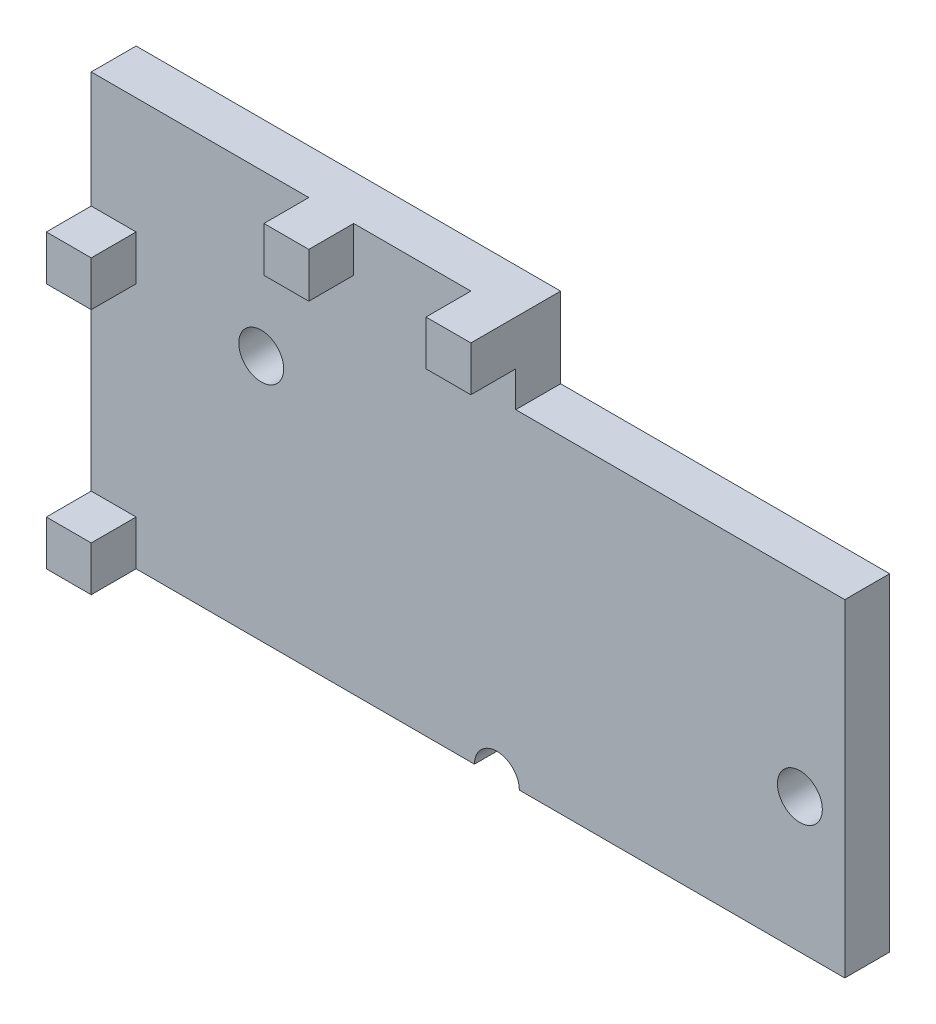
ISO-10303-21;
HEADER;
FILE_DESCRIPTION(('STEP AP214'),'2;1');
FILE_NAME('part.step','',(''),(''),'','','');
FILE_SCHEMA(('AUTOMOTIVE_DESIGN { 1 0 10303 214 1 1 1 1 }'));
ENDSEC;
DATA;
#1=APPLICATION_CONTEXT('core data for automotive mechanical design processes');
#2=APPLICATION_PROTOCOL_DEFINITION('international standard','automotive_design',2000,#1);
#3=PRODUCT_CONTEXT('',#1,'mechanical');
#4=PRODUCT('Part','Part','',(#3));
#5=PRODUCT_RELATED_PRODUCT_CATEGORY('part','',(#4));
#6=PRODUCT_DEFINITION_FORMATION('','',#4);
#7=PRODUCT_DEFINITION_CONTEXT('part definition',#1,'design');
#8=PRODUCT_DEFINITION('design','',#6,#7);
#9=PRODUCT_DEFINITION_SHAPE('','',#8);
#10=(LENGTH_UNIT() NAMED_UNIT(*) SI_UNIT(.MILLI.,.METRE.));
#11=(NAMED_UNIT(*) PLANE_ANGLE_UNIT() SI_UNIT($,.RADIAN.));
#12=(NAMED_UNIT(*) SI_UNIT($,.STERADIAN.) SOLID_ANGLE_UNIT());
#13=UNCERTAINTY_MEASURE_WITH_UNIT(LENGTH_MEASURE(1.E-05),#10,'distance_accuracy_value','');
#14=(GEOMETRIC_REPRESENTATION_CONTEXT(3) GLOBAL_UNCERTAINTY_ASSIGNED_CONTEXT((#13)) GLOBAL_UNIT_ASSIGNED_CONTEXT((#10,
#11,#12)) REPRESENTATION_CONTEXT('',''));
#15=CARTESIAN_POINT('',(0.,0.,0.));
#16=DIRECTION('',(0.,0.,1.));
#17=DIRECTION('',(1.,0.,0.));
#18=AXIS2_PLACEMENT_3D('',#15,#16,#17);
#19=CARTESIAN_POINT('',(0.169999999999999,5.8374,1.));
#20=DIRECTION('',(-1.,0.,0.));
#21=DIRECTION('',(0.,-1.,0.));
#22=AXIS2_PLACEMENT_3D('',#19,#20,#21);
#23=PLANE('',#22);
#24=DIRECTION('',(0.,0.,1.));
#25=VECTOR('',#24,1.);
#26=CARTESIAN_POINT('',(0.17,4.05,1.));
#27=LINE('',#26,#25);
#28=CARTESIAN_POINT('',(0.17,4.05,0.));
#29=VERTEX_POINT('',#28);
#30=CARTESIAN_POINT('',(0.17,4.05,1.));
#31=VERTEX_POINT('',#30);
#32=EDGE_CURVE('E51',#29,#31,#27,.T.);
#33=ORIENTED_EDGE('',*,*,#32,.F.);
#34=DIRECTION('',(0.,-1.,0.));
#35=VECTOR('',#34,1.);
#36=CARTESIAN_POINT('',(0.169999999999999,5.8374,0.));
#37=LINE('',#36,#35);
#38=CARTESIAN_POINT('',(0.169999999999999,5.8374,0.));
#39=VERTEX_POINT('',#38);
#40=EDGE_CURVE('E285',#39,#29,#37,.T.);
#41=ORIENTED_EDGE('',*,*,#40,.F.);
#42=DIRECTION('',(0.,0.,-1.));
#43=VECTOR('',#42,1.);
#44=CARTESIAN_POINT('',(0.169999999999999,5.8374,1.));
#45=LINE('',#44,#43);
#46=CARTESIAN_POINT('',(0.170000000000001,5.8374,2.));
#47=VERTEX_POINT('',#46);
#48=EDGE_CURVE('E258',#47,#39,#45,.T.);
#49=ORIENTED_EDGE('',*,*,#48,.F.);
#50=DIRECTION('',(0.,1.,0.));
#51=VECTOR('',#50,1.);
#52=CARTESIAN_POINT('',(0.170000000000001,5.8374,2.));
#53=LINE('',#52,#51);
#54=CARTESIAN_POINT('',(0.170000000000001,4.8374,2.));
#55=VERTEX_POINT('',#54);
#56=EDGE_CURVE('E238',#55,#47,#53,.T.);
#57=ORIENTED_EDGE('',*,*,#56,.F.);
#58=DIRECTION('',(0.,0.,-1.));
#59=VECTOR('',#58,1.);
#60=CARTESIAN_POINT('',(0.170000000000001,4.8374,2.));
#61=LINE('',#60,#59);
#62=CARTESIAN_POINT('',(0.170000000000001,4.8374,1.));
#63=VERTEX_POINT('',#62);
#64=EDGE_CURVE('E190',#55,#63,#61,.T.);
#65=ORIENTED_EDGE('',*,*,#64,.T.);
#66=DIRECTION('',(0.,-1.,0.));
#67=VECTOR('',#66,1.);
#68=CARTESIAN_POINT('',(0.169999999999999,5.8374,1.));
#69=LINE('',#68,#67);
#70=EDGE_CURVE('E37',#63,#31,#69,.T.);
#71=ORIENTED_EDGE('',*,*,#70,.T.);
#72=EDGE_LOOP('',(#33,#41,#49,#57,#65,#71));
#73=FACE_BOUND('',#72,.T.);
#74=ADVANCED_FACE('F33',(#73),#23,.F.);
#75=CARTESIAN_POINT('',(-0.249999999999998,-3.25,1.));
#76=DIRECTION('',(0.,0.,1.));
#77=DIRECTION('',(1.,0.,0.));
#78=AXIS2_PLACEMENT_3D('',#75,#76,#77);
#79=PLANE('',#78);
#80=CARTESIAN_POINT('',(-5.5,2.25,1.));
#81=DIRECTION('',(0.,0.,1.));
#82=DIRECTION('',(1.,0.,0.));
#83=AXIS2_PLACEMENT_3D('',#80,#81,#82);
#84=CIRCLE('',#83,0.5);
#85=CARTESIAN_POINT('',(-5.,2.25,1.));
#86=VERTEX_POINT('',#85);
#87=EDGE_CURVE('E338',#86,#86,#84,.T.);
#88=ORIENTED_EDGE('',*,*,#87,.F.);
#89=EDGE_LOOP('',(#88));
#90=FACE_BOUND('',#89,.T.);
#91=CARTESIAN_POINT('',(6.5,-0.249999999999999,1.));
#92=DIRECTION('',(0.,0.,1.));
#93=DIRECTION('',(1.,0.,0.));
#94=AXIS2_PLACEMENT_3D('',#91,#92,#93);
#95=CIRCLE('',#94,0.500000000000001);
#96=CARTESIAN_POINT('',(7.,-0.249999999999999,1.));
#97=VERTEX_POINT('',#96);
#98=EDGE_CURVE('E331',#97,#97,#95,.T.);
#99=ORIENTED_EDGE('',*,*,#98,.F.);
#100=EDGE_LOOP('',(#99));
#101=FACE_BOUND('',#100,.T.);
#102=DIRECTION('',(1.,0.,0.));
#103=VECTOR('',#102,1.);
#104=CARTESIAN_POINT('',(0.169999999999999,5.8374,1.));
#105=LINE('',#104,#103);
#106=CARTESIAN_POINT('',(-3.44,5.8374,1.));
#107=VERTEX_POINT('',#106);
#108=CARTESIAN_POINT('',(-0.829999999999999,5.8374,1.));
#109=VERTEX_POINT('',#108);
#110=EDGE_CURVE('E266',#107,#109,#105,.T.);
#111=ORIENTED_EDGE('',*,*,#110,.F.);
#112=DIRECTION('',(0.,1.,0.));
#113=VECTOR('',#112,1.);
#114=CARTESIAN_POINT('',(-3.44,5.8374,1.));
#115=LINE('',#114,#113);
#116=CARTESIAN_POINT('',(-3.44,4.8374,1.));
#117=VERTEX_POINT('',#116);
#118=EDGE_CURVE('E59',#117,#107,#115,.T.);
#119=ORIENTED_EDGE('',*,*,#118,.F.);
#120=DIRECTION('',(1.,0.,0.));
#121=VECTOR('',#120,1.);
#122=CARTESIAN_POINT('',(-3.44,4.8374,1.));
#123=LINE('',#122,#121);
#124=CARTESIAN_POINT('',(-4.44,4.8374,1.));
#125=VERTEX_POINT('',#124);
#126=EDGE_CURVE('E218',#125,#117,#123,.T.);
#127=ORIENTED_EDGE('',*,*,#126,.F.);
#128=DIRECTION('',(0.,-1.,0.));
#129=VECTOR('',#128,1.);
#130=CARTESIAN_POINT('',(-4.44,5.8374,1.));
#131=LINE('',#130,#129);
#132=CARTESIAN_POINT('',(-4.44,5.8374,1.));
#133=VERTEX_POINT('',#132);
#134=EDGE_CURVE('E226',#133,#125,#131,.T.);
#135=ORIENTED_EDGE('',*,*,#134,.F.);
#136=CARTESIAN_POINT('',(-9.2874,5.8374,1.));
#137=VERTEX_POINT('',#136);
#138=EDGE_CURVE('E194',#137,#133,#105,.T.);
#139=ORIENTED_EDGE('',*,*,#138,.F.);
#140=DIRECTION('',(0.,-1.,0.));
#141=VECTOR('',#140,1.);
#142=CARTESIAN_POINT('',(-9.2874,5.8374,1.));
#143=LINE('',#142,#141);
#144=CARTESIAN_POINT('',(-9.2874,3.25,1.));
#145=VERTEX_POINT('',#144);
#146=EDGE_CURVE('E193',#137,#145,#143,.T.);
#147=ORIENTED_EDGE('',*,*,#146,.T.);
#148=DIRECTION('',(1.,0.,0.));
#149=VECTOR('',#148,1.);
#150=CARTESIAN_POINT('',(0.17,3.25,1.));
#151=LINE('',#150,#149);
#152=CARTESIAN_POINT('',(-8.2874,3.25,1.));
#153=VERTEX_POINT('',#152);
#154=EDGE_CURVE('E257',#145,#153,#151,.T.);
#155=ORIENTED_EDGE('',*,*,#154,.T.);
#156=DIRECTION('',(0.,1.,0.));
#157=VECTOR('',#156,1.);
#158=CARTESIAN_POINT('',(-8.2874,3.25,1.));
#159=LINE('',#158,#157);
#160=CARTESIAN_POINT('',(-8.2874,2.25,1.));
#161=VERTEX_POINT('',#160);
#162=EDGE_CURVE('E299',#161,#153,#159,.T.);
#163=ORIENTED_EDGE('',*,*,#162,.F.);
#164=DIRECTION('',(1.,0.,0.));
#165=VECTOR('',#164,1.);
#166=CARTESIAN_POINT('',(-9.2874,2.25,1.));
#167=LINE('',#166,#165);
#168=CARTESIAN_POINT('',(-9.2874,2.25,1.));
#169=VERTEX_POINT('',#168);
#170=EDGE_CURVE('E294',#169,#161,#167,.T.);
#171=ORIENTED_EDGE('',*,*,#170,.F.);
#172=DIRECTION('',(0.,1.,0.));
#173=VECTOR('',#172,1.);
#174=CARTESIAN_POINT('',(-9.2874,3.25,1.));
#175=LINE('',#174,#173);
#176=CARTESIAN_POINT('',(-9.2874,-2.25,1.));
#177=VERTEX_POINT('',#176);
#178=EDGE_CURVE('E321',#177,#169,#175,.T.);
#179=ORIENTED_EDGE('',*,*,#178,.F.);
#180=DIRECTION('',(-1.,0.,0.));
#181=VECTOR('',#180,1.);
#182=CARTESIAN_POINT('',(-9.2874,-2.25,1.));
#183=LINE('',#182,#181);
#184=CARTESIAN_POINT('',(-8.28739999999999,-2.25,1.));
#185=VERTEX_POINT('',#184);
#186=EDGE_CURVE('E276',#185,#177,#183,.T.);
#187=ORIENTED_EDGE('',*,*,#186,.F.);
#188=DIRECTION('',(0.,1.,0.));
#189=VECTOR('',#188,1.);
#190=CARTESIAN_POINT('',(-8.28739999999999,-3.25,1.));
#191=LINE('',#190,#189);
#192=CARTESIAN_POINT('',(-8.28739999999999,-3.25,1.));
#193=VERTEX_POINT('',#192);
#194=EDGE_CURVE('E283',#193,#185,#191,.T.);
#195=ORIENTED_EDGE('',*,*,#194,.F.);
#196=DIRECTION('',(1.,0.,0.));
#197=VECTOR('',#196,1.);
#198=CARTESIAN_POINT('',(-0.749999999999998,-3.25,1.));
#199=LINE('',#198,#197);
#200=CARTESIAN_POINT('',(-0.749999999999998,-3.25,1.));
#201=VERTEX_POINT('',#200);
#202=EDGE_CURVE('E344',#193,#201,#199,.T.);
#203=ORIENTED_EDGE('',*,*,#202,.T.);
#204=CARTESIAN_POINT('',(-0.249999999999998,-3.25,1.));
#205=DIRECTION('',(0.,0.,-1.));
#206=DIRECTION('',(1.,0.,0.));
#207=AXIS2_PLACEMENT_3D('',#204,#205,#206);
#208=CIRCLE('',#207,0.5);
#209=CARTESIAN_POINT('',(0.250000000000002,-3.25,1.));
#210=VERTEX_POINT('',#209);
#211=EDGE_CURVE('E346',#201,#210,#208,.T.);
#212=ORIENTED_EDGE('',*,*,#211,.T.);
#213=DIRECTION('',(1.,0.,0.));
#214=VECTOR('',#213,1.);
#215=CARTESIAN_POINT('',(7.5,-3.25,1.));
#216=LINE('',#215,#214);
#217=CARTESIAN_POINT('',(7.5,-3.25,1.));
#218=VERTEX_POINT('',#217);
#219=EDGE_CURVE('E349',#210,#218,#216,.T.);
#220=ORIENTED_EDGE('',*,*,#219,.T.);
#221=DIRECTION('',(0.,1.,0.));
#222=VECTOR('',#221,1.);
#223=CARTESIAN_POINT('',(7.5,3.25,1.));
#224=LINE('',#223,#222);
#225=CARTESIAN_POINT('',(7.5,4.05,1.));
#226=VERTEX_POINT('',#225);
#227=EDGE_CURVE('E200',#218,#226,#224,.T.);
#228=ORIENTED_EDGE('',*,*,#227,.T.);
#229=DIRECTION('',(1.,0.,0.));
#230=VECTOR('',#229,1.);
#231=CARTESIAN_POINT('',(0.17,4.05,1.));
#232=LINE('',#231,#230);
#233=EDGE_CURVE('E196',#31,#226,#232,.T.);
#234=ORIENTED_EDGE('',*,*,#233,.F.);
#235=ORIENTED_EDGE('',*,*,#70,.F.);
#236=DIRECTION('',(1.,0.,0.));
#237=VECTOR('',#236,1.);
#238=CARTESIAN_POINT('',(0.170000000000001,4.8374,1.));
#239=LINE('',#238,#237);
#240=CARTESIAN_POINT('',(-0.829999999999999,4.8374,1.));
#241=VERTEX_POINT('',#240);
#242=EDGE_CURVE('E242',#241,#63,#239,.T.);
#243=ORIENTED_EDGE('',*,*,#242,.F.);
#244=DIRECTION('',(0.,-1.,0.));
#245=VECTOR('',#244,1.);
#246=CARTESIAN_POINT('',(-0.829999999999999,5.8374,1.));
#247=LINE('',#246,#245);
#248=EDGE_CURVE('E237',#109,#241,#247,.T.);
#249=ORIENTED_EDGE('',*,*,#248,.F.);
#250=EDGE_LOOP('',(#111,#119,#127,#135,#139,#147,#155,#163,#171,#179,#187,#195,#203,#212,#220,
#228,#234,#235,#243,#249));
#251=FACE_BOUND('',#250,.T.);
#252=ADVANCED_FACE('F198',(#90,#101,#251),#79,.T.);
#253=CARTESIAN_POINT('',(7.5,3.25,1.));
#254=DIRECTION('',(0.,-1.,0.));
#255=DIRECTION('',(1.,0.,0.));
#256=AXIS2_PLACEMENT_3D('',#253,#254,#255);
#257=PLANE('',#256);
#258=ORIENTED_EDGE('',*,*,#154,.F.);
#259=DIRECTION('',(0.,0.,-1.));
#260=VECTOR('',#259,1.);
#261=CARTESIAN_POINT('',(-9.2874,3.25,0.));
#262=LINE('',#261,#260);
#263=CARTESIAN_POINT('',(-9.2874,3.25,2.));
#264=VERTEX_POINT('',#263);
#265=EDGE_CURVE('E324',#264,#145,#262,.T.);
#266=ORIENTED_EDGE('',*,*,#265,.F.);
#267=DIRECTION('',(-1.,0.,0.));
#268=VECTOR('',#267,1.);
#269=CARTESIAN_POINT('',(-9.2874,3.25,2.));
#270=LINE('',#269,#268);
#271=CARTESIAN_POINT('',(-8.2874,3.25,2.));
#272=VERTEX_POINT('',#271);
#273=EDGE_CURVE('E303',#272,#264,#270,.T.);
#274=ORIENTED_EDGE('',*,*,#273,.F.);
#275=DIRECTION('',(0.,0.,-1.));
#276=VECTOR('',#275,1.);
#277=CARTESIAN_POINT('',(-8.2874,3.25,2.));
#278=LINE('',#277,#276);
#279=EDGE_CURVE('E306',#272,#153,#278,.T.);
#280=ORIENTED_EDGE('',*,*,#279,.T.);
#281=EDGE_LOOP('',(#258,#266,#274,#280));
#282=FACE_BOUND('',#281,.T.);
#283=ADVANCED_FACE('F387',(#282),#257,.F.);
#284=CARTESIAN_POINT('',(-0.249999999999998,-3.25,0.));
#285=DIRECTION('',(0.,0.,1.));
#286=DIRECTION('',(1.,0.,0.));
#287=AXIS2_PLACEMENT_3D('',#284,#285,#286);
#288=PLANE('',#287);
#289=DIRECTION('',(1.,0.,0.));
#290=VECTOR('',#289,1.);
#291=CARTESIAN_POINT('',(-0.749999999999998,-3.25,0.));
#292=LINE('',#291,#290);
#293=CARTESIAN_POINT('',(-9.2874,-3.25,0.));
#294=VERTEX_POINT('',#293);
#295=CARTESIAN_POINT('',(-0.749999999999998,-3.25,0.));
#296=VERTEX_POINT('',#295);
#297=EDGE_CURVE('E341',#294,#296,#292,.T.);
#298=ORIENTED_EDGE('',*,*,#297,.F.);
#299=DIRECTION('',(0.,-1.,0.));
#300=VECTOR('',#299,1.);
#301=CARTESIAN_POINT('',(-9.2874,3.25,0.));
#302=LINE('',#301,#300);
#303=CARTESIAN_POINT('',(-9.2874,5.8374,0.));
#304=VERTEX_POINT('',#303);
#305=EDGE_CURVE('E368',#304,#294,#302,.T.);
#306=ORIENTED_EDGE('',*,*,#305,.F.);
#307=DIRECTION('',(-1.,0.,0.));
#308=VECTOR('',#307,1.);
#309=CARTESIAN_POINT('',(0.169999999999999,5.8374,0.));
#310=LINE('',#309,#308);
#311=EDGE_CURVE('E261',#39,#304,#310,.T.);
#312=ORIENTED_EDGE('',*,*,#311,.F.);
#313=ORIENTED_EDGE('',*,*,#40,.T.);
#314=DIRECTION('',(-1.,0.,0.));
#315=VECTOR('',#314,1.);
#316=CARTESIAN_POINT('',(0.17,4.05,0.));
#317=LINE('',#316,#315);
#318=CARTESIAN_POINT('',(7.5,4.05,0.));
#319=VERTEX_POINT('',#318);
#320=EDGE_CURVE('E209',#319,#29,#317,.T.);
#321=ORIENTED_EDGE('',*,*,#320,.F.);
#322=DIRECTION('',(0.,1.,0.));
#323=VECTOR('',#322,1.);
#324=CARTESIAN_POINT('',(7.5,3.25,0.));
#325=LINE('',#324,#323);
#326=CARTESIAN_POINT('',(7.5,-3.25,0.));
#327=VERTEX_POINT('',#326);
#328=EDGE_CURVE('E347',#327,#319,#325,.T.);
#329=ORIENTED_EDGE('',*,*,#328,.F.);
#330=DIRECTION('',(1.,0.,0.));
#331=VECTOR('',#330,1.);
#332=CARTESIAN_POINT('',(7.5,-3.25,0.));
#333=LINE('',#332,#331);
#334=CARTESIAN_POINT('',(0.250000000000002,-3.25,0.));
#335=VERTEX_POINT('',#334);
#336=EDGE_CURVE('E356',#335,#327,#333,.T.);
#337=ORIENTED_EDGE('',*,*,#336,.F.);
#338=CARTESIAN_POINT('',(-0.249999999999998,-3.25,0.));
#339=DIRECTION('',(0.,0.,-1.));
#340=DIRECTION('',(1.,0.,0.));
#341=AXIS2_PLACEMENT_3D('',#338,#339,#340);
#342=CIRCLE('',#341,0.5);
#343=EDGE_CURVE('E354',#296,#335,#342,.T.);
#344=ORIENTED_EDGE('',*,*,#343,.F.);
#345=EDGE_LOOP('',(#298,#306,#312,#313,#321,#329,#337,#344));
#346=FACE_BOUND('',#345,.T.);
#347=CARTESIAN_POINT('',(-5.5,2.25,0.));
#348=DIRECTION('',(0.,0.,1.));
#349=DIRECTION('',(1.,0.,0.));
#350=AXIS2_PLACEMENT_3D('',#347,#348,#349);
#351=CIRCLE('',#350,0.5);
#352=CARTESIAN_POINT('',(-5.,2.25,0.));
#353=VERTEX_POINT('',#352);
#354=EDGE_CURVE('E334',#353,#353,#351,.T.);
#355=ORIENTED_EDGE('',*,*,#354,.T.);
#356=EDGE_LOOP('',(#355));
#357=FACE_BOUND('',#356,.T.);
#358=CARTESIAN_POINT('',(6.5,-0.249999999999999,0.));
#359=DIRECTION('',(0.,0.,1.));
#360=DIRECTION('',(1.,0.,0.));
#361=AXIS2_PLACEMENT_3D('',#358,#359,#360);
#362=CIRCLE('',#361,0.500000000000001);
#363=CARTESIAN_POINT('',(7.,-0.249999999999999,0.));
#364=VERTEX_POINT('',#363);
#365=EDGE_CURVE('E335',#364,#364,#362,.T.);
#366=ORIENTED_EDGE('',*,*,#365,.T.);
#367=EDGE_LOOP('',(#366));
#368=FACE_BOUND('',#367,.T.);
#369=ADVANCED_FACE('F453',(#346,#357,#368),#288,.F.);
#370=CARTESIAN_POINT('',(-0.749999999999998,-3.25,1.));
#371=DIRECTION('',(0.,1.,0.));
#372=DIRECTION('',(-1.,0.,0.));
#373=AXIS2_PLACEMENT_3D('',#370,#371,#372);
#374=PLANE('',#373);
#375=ORIENTED_EDGE('',*,*,#297,.T.);
#376=DIRECTION('',(0.,0.,-1.));
#377=VECTOR('',#376,1.);
#378=CARTESIAN_POINT('',(-0.749999999999998,-3.25,1.));
#379=LINE('',#378,#377);
#380=EDGE_CURVE('E11',#201,#296,#379,.T.);
#381=ORIENTED_EDGE('',*,*,#380,.F.);
#382=ORIENTED_EDGE('',*,*,#202,.F.);
#383=DIRECTION('',(0.,0.,-1.));
#384=VECTOR('',#383,1.);
#385=CARTESIAN_POINT('',(-8.28739999999999,-3.25,2.));
#386=LINE('',#385,#384);
#387=CARTESIAN_POINT('',(-8.28739999999999,-3.25,2.));
#388=VERTEX_POINT('',#387);
#389=EDGE_CURVE('E292',#388,#193,#386,.T.);
#390=ORIENTED_EDGE('',*,*,#389,.F.);
#391=DIRECTION('',(1.,0.,0.));
#392=VECTOR('',#391,1.);
#393=CARTESIAN_POINT('',(-9.2874,-3.25,2.));
#394=LINE('',#393,#392);
#395=CARTESIAN_POINT('',(-9.2874,-3.25,2.));
#396=VERTEX_POINT('',#395);
#397=EDGE_CURVE('E275',#396,#388,#394,.T.);
#398=ORIENTED_EDGE('',*,*,#397,.F.);
#399=DIRECTION('',(0.,0.,1.));
#400=VECTOR('',#399,1.);
#401=CARTESIAN_POINT('',(-9.2874,-3.25,0.));
#402=LINE('',#401,#400);
#403=EDGE_CURVE('E325',#294,#396,#402,.T.);
#404=ORIENTED_EDGE('',*,*,#403,.F.);
#405=EDGE_LOOP('',(#375,#381,#382,#390,#398,#404));
#406=FACE_BOUND('',#405,.T.);
#407=ADVANCED_FACE('F35',(#406),#374,.F.);
#408=CARTESIAN_POINT('',(-0.249999999999998,-3.25,1.));
#409=DIRECTION('',(0.,0.,-1.));
#410=DIRECTION('',(-1.,0.,0.));
#411=AXIS2_PLACEMENT_3D('',#408,#409,#410);
#412=CYLINDRICAL_SURFACE('',#411,0.5);
#413=ORIENTED_EDGE('',*,*,#343,.T.);
#414=DIRECTION('',(0.,0.,-1.));
#415=VECTOR('',#414,1.);
#416=CARTESIAN_POINT('',(0.250000000000002,-3.25,1.));
#417=LINE('',#416,#415);
#418=EDGE_CURVE('E43',#210,#335,#417,.T.);
#419=ORIENTED_EDGE('',*,*,#418,.F.);
#420=ORIENTED_EDGE('',*,*,#211,.F.);
#421=ORIENTED_EDGE('',*,*,#380,.T.);
#422=EDGE_LOOP('',(#413,#419,#420,#421));
#423=FACE_BOUND('',#422,.T.);
#424=ADVANCED_FACE('F443',(#423),#412,.F.);
#425=CARTESIAN_POINT('',(7.5,-3.25,1.));
#426=DIRECTION('',(0.,1.,0.));
#427=DIRECTION('',(-1.,0.,0.));
#428=AXIS2_PLACEMENT_3D('',#425,#426,#427);
#429=PLANE('',#428);
#430=ORIENTED_EDGE('',*,*,#336,.T.);
#431=DIRECTION('',(0.,0.,-1.));
#432=VECTOR('',#431,1.);
#433=CARTESIAN_POINT('',(7.5,-3.25,1.));
#434=LINE('',#433,#432);
#435=EDGE_CURVE('E352',#218,#327,#434,.T.);
#436=ORIENTED_EDGE('',*,*,#435,.F.);
#437=ORIENTED_EDGE('',*,*,#219,.F.);
#438=ORIENTED_EDGE('',*,*,#418,.T.);
#439=EDGE_LOOP('',(#430,#436,#437,#438));
#440=FACE_BOUND('',#439,.T.);
#441=ADVANCED_FACE('F447',(#440),#429,.F.);
#442=CARTESIAN_POINT('',(7.5,3.25,1.));
#443=DIRECTION('',(-1.,0.,0.));
#444=DIRECTION('',(0.,-1.,0.));
#445=AXIS2_PLACEMENT_3D('',#442,#443,#444);
#446=PLANE('',#445);
#447=ORIENTED_EDGE('',*,*,#328,.T.);
#448=DIRECTION('',(0.,0.,-1.));
#449=VECTOR('',#448,1.);
#450=CARTESIAN_POINT('',(7.5,4.05,1.));
#451=LINE('',#450,#449);
#452=EDGE_CURVE('E204',#226,#319,#451,.T.);
#453=ORIENTED_EDGE('',*,*,#452,.F.);
#454=ORIENTED_EDGE('',*,*,#227,.F.);
#455=ORIENTED_EDGE('',*,*,#435,.T.);
#456=EDGE_LOOP('',(#447,#453,#454,#455));
#457=FACE_BOUND('',#456,.T.);
#458=ADVANCED_FACE('F451',(#457),#446,.F.);
#459=CARTESIAN_POINT('',(-5.5,2.25,1.));
#460=DIRECTION('',(0.,0.,-1.));
#461=DIRECTION('',(-1.,0.,0.));
#462=AXIS2_PLACEMENT_3D('',#459,#460,#461);
#463=CYLINDRICAL_SURFACE('',#462,0.5);
#464=ORIENTED_EDGE('',*,*,#87,.T.);
#465=EDGE_LOOP('',(#464));
#466=FACE_BOUND('',#465,.T.);
#467=ORIENTED_EDGE('',*,*,#354,.F.);
#468=EDGE_LOOP('',(#467));
#469=FACE_BOUND('',#468,.T.);
#470=ADVANCED_FACE('F507',(#466,#469),#463,.F.);
#471=CARTESIAN_POINT('',(6.5,-0.249999999999999,1.));
#472=DIRECTION('',(0.,0.,-1.));
#473=DIRECTION('',(-1.,0.,0.));
#474=AXIS2_PLACEMENT_3D('',#471,#472,#473);
#475=CYLINDRICAL_SURFACE('',#474,0.500000000000001);
#476=ORIENTED_EDGE('',*,*,#98,.T.);
#477=EDGE_LOOP('',(#476));
#478=FACE_BOUND('',#477,.T.);
#479=ORIENTED_EDGE('',*,*,#365,.F.);
#480=EDGE_LOOP('',(#479));
#481=FACE_BOUND('',#480,.T.);
#482=ADVANCED_FACE('F574',(#478,#481),#475,.F.);
#483=CARTESIAN_POINT('',(-9.2874,0.,0.));
#484=DIRECTION('',(-1.,0.,0.));
#485=DIRECTION('',(0.,0.,1.));
#486=AXIS2_PLACEMENT_3D('',#483,#484,#485);
#487=PLANE('',#486);
#488=ORIENTED_EDGE('',*,*,#305,.T.);
#489=ORIENTED_EDGE('',*,*,#403,.T.);
#490=DIRECTION('',(0.,-1.,0.));
#491=VECTOR('',#490,1.);
#492=CARTESIAN_POINT('',(-9.2874,-3.25,2.));
#493=LINE('',#492,#491);
#494=CARTESIAN_POINT('',(-9.2874,-2.25,2.));
#495=VERTEX_POINT('',#494);
#496=EDGE_CURVE('E272',#495,#396,#493,.T.);
#497=ORIENTED_EDGE('',*,*,#496,.F.);
#498=DIRECTION('',(0.,0.,-1.));
#499=VECTOR('',#498,1.);
#500=CARTESIAN_POINT('',(-9.2874,-2.25,2.));
#501=LINE('',#500,#499);
#502=EDGE_CURVE('E282',#495,#177,#501,.T.);
#503=ORIENTED_EDGE('',*,*,#502,.T.);
#504=ORIENTED_EDGE('',*,*,#178,.T.);
#505=DIRECTION('',(0.,0.,-1.));
#506=VECTOR('',#505,1.);
#507=CARTESIAN_POINT('',(-9.2874,2.25,2.));
#508=LINE('',#507,#506);
#509=CARTESIAN_POINT('',(-9.2874,2.25,2.));
#510=VERTEX_POINT('',#509);
#511=EDGE_CURVE('E366',#510,#169,#508,.T.);
#512=ORIENTED_EDGE('',*,*,#511,.F.);
#513=DIRECTION('',(0.,-1.,0.));
#514=VECTOR('',#513,1.);
#515=CARTESIAN_POINT('',(-9.2874,3.25,2.));
#516=LINE('',#515,#514);
#517=EDGE_CURVE('E295',#264,#510,#516,.T.);
#518=ORIENTED_EDGE('',*,*,#517,.F.);
#519=ORIENTED_EDGE('',*,*,#265,.T.);
#520=ORIENTED_EDGE('',*,*,#146,.F.);
#521=DIRECTION('',(0.,0.,1.));
#522=VECTOR('',#521,1.);
#523=CARTESIAN_POINT('',(-9.2874,5.8374,1.));
#524=LINE('',#523,#522);
#525=EDGE_CURVE('E264',#304,#137,#524,.T.);
#526=ORIENTED_EDGE('',*,*,#525,.F.);
#527=EDGE_LOOP('',(#488,#489,#497,#503,#504,#512,#518,#519,#520,#526));
#528=FACE_BOUND('',#527,.T.);
#529=ADVANCED_FACE('F391',(#528),#487,.T.);
#530=CARTESIAN_POINT('',(-9.2874,2.25,2.));
#531=DIRECTION('',(0.,1.,0.));
#532=DIRECTION('',(0.,0.,1.));
#533=AXIS2_PLACEMENT_3D('',#530,#531,#532);
#534=PLANE('',#533);
#535=ORIENTED_EDGE('',*,*,#170,.T.);
#536=DIRECTION('',(0.,0.,-1.));
#537=VECTOR('',#536,1.);
#538=CARTESIAN_POINT('',(-8.2874,2.25,2.));
#539=LINE('',#538,#537);
#540=CARTESIAN_POINT('',(-8.2874,2.25,2.));
#541=VERTEX_POINT('',#540);
#542=EDGE_CURVE('E309',#541,#161,#539,.T.);
#543=ORIENTED_EDGE('',*,*,#542,.F.);
#544=DIRECTION('',(1.,0.,0.));
#545=VECTOR('',#544,1.);
#546=CARTESIAN_POINT('',(-9.2874,2.25,2.));
#547=LINE('',#546,#545);
#548=EDGE_CURVE('E298',#510,#541,#547,.T.);
#549=ORIENTED_EDGE('',*,*,#548,.F.);
#550=ORIENTED_EDGE('',*,*,#511,.T.);
#551=EDGE_LOOP('',(#535,#543,#549,#550));
#552=FACE_BOUND('',#551,.T.);
#553=ADVANCED_FACE('F378',(#552),#534,.F.);
#554=CARTESIAN_POINT('',(-8.2874,3.25,2.));
#555=DIRECTION('',(-1.,0.,0.));
#556=DIRECTION('',(0.,0.,1.));
#557=AXIS2_PLACEMENT_3D('',#554,#555,#556);
#558=PLANE('',#557);
#559=ORIENTED_EDGE('',*,*,#162,.T.);
#560=ORIENTED_EDGE('',*,*,#279,.F.);
#561=DIRECTION('',(0.,1.,0.));
#562=VECTOR('',#561,1.);
#563=CARTESIAN_POINT('',(-8.2874,3.25,2.));
#564=LINE('',#563,#562);
#565=EDGE_CURVE('E301',#541,#272,#564,.T.);
#566=ORIENTED_EDGE('',*,*,#565,.F.);
#567=ORIENTED_EDGE('',*,*,#542,.T.);
#568=EDGE_LOOP('',(#559,#560,#566,#567));
#569=FACE_BOUND('',#568,.T.);
#570=ADVANCED_FACE('F376',(#569),#558,.F.);
#571=CARTESIAN_POINT('',(0.,0.,2.));
#572=DIRECTION('',(0.,0.,1.));
#573=DIRECTION('',(1.,0.,0.));
#574=AXIS2_PLACEMENT_3D('',#571,#572,#573);
#575=PLANE('',#574);
#576=ORIENTED_EDGE('',*,*,#517,.T.);
#577=ORIENTED_EDGE('',*,*,#548,.T.);
#578=ORIENTED_EDGE('',*,*,#565,.T.);
#579=ORIENTED_EDGE('',*,*,#273,.T.);
#580=EDGE_LOOP('',(#576,#577,#578,#579));
#581=FACE_BOUND('',#580,.T.);
#582=ADVANCED_FACE('F394',(#581),#575,.T.);
#583=CARTESIAN_POINT('',(-8.28739999999999,-3.25,2.));
#584=DIRECTION('',(-1.,0.,0.));
#585=DIRECTION('',(0.,-1.,0.));
#586=AXIS2_PLACEMENT_3D('',#583,#584,#585);
#587=PLANE('',#586);
#588=ORIENTED_EDGE('',*,*,#194,.T.);
#589=DIRECTION('',(0.,0.,-1.));
#590=VECTOR('',#589,1.);
#591=CARTESIAN_POINT('',(-8.28739999999999,-2.25,2.));
#592=LINE('',#591,#590);
#593=CARTESIAN_POINT('',(-8.28739999999999,-2.25,2.));
#594=VERTEX_POINT('',#593);
#595=EDGE_CURVE('E289',#594,#185,#592,.T.);
#596=ORIENTED_EDGE('',*,*,#595,.F.);
#597=DIRECTION('',(0.,1.,0.));
#598=VECTOR('',#597,1.);
#599=CARTESIAN_POINT('',(-8.28739999999999,-3.25,2.));
#600=LINE('',#599,#598);
#601=EDGE_CURVE('E278',#388,#594,#600,.T.);
#602=ORIENTED_EDGE('',*,*,#601,.F.);
#603=ORIENTED_EDGE('',*,*,#389,.T.);
#604=EDGE_LOOP('',(#588,#596,#602,#603));
#605=FACE_BOUND('',#604,.T.);
#606=ADVANCED_FACE('F396',(#605),#587,.F.);
#607=CARTESIAN_POINT('',(-9.2874,-2.25,2.));
#608=DIRECTION('',(0.,-1.,0.));
#609=DIRECTION('',(0.,0.,-1.));
#610=AXIS2_PLACEMENT_3D('',#607,#608,#609);
#611=PLANE('',#610);
#612=ORIENTED_EDGE('',*,*,#186,.T.);
#613=ORIENTED_EDGE('',*,*,#502,.F.);
#614=DIRECTION('',(-1.,0.,0.));
#615=VECTOR('',#614,1.);
#616=CARTESIAN_POINT('',(-9.2874,-2.25,2.));
#617=LINE('',#616,#615);
#618=EDGE_CURVE('E280',#594,#495,#617,.T.);
#619=ORIENTED_EDGE('',*,*,#618,.F.);
#620=ORIENTED_EDGE('',*,*,#595,.T.);
#621=EDGE_LOOP('',(#612,#613,#619,#620));
#622=FACE_BOUND('',#621,.T.);
#623=ADVANCED_FACE('F402',(#622),#611,.F.);
#624=CARTESIAN_POINT('',(0.,0.,2.));
#625=DIRECTION('',(0.,0.,-1.));
#626=DIRECTION('',(-1.,0.,0.));
#627=AXIS2_PLACEMENT_3D('',#624,#625,#626);
#628=PLANE('',#627);
#629=ORIENTED_EDGE('',*,*,#496,.T.);
#630=ORIENTED_EDGE('',*,*,#397,.T.);
#631=ORIENTED_EDGE('',*,*,#601,.T.);
#632=ORIENTED_EDGE('',*,*,#618,.T.);
#633=EDGE_LOOP('',(#629,#630,#631,#632));
#634=FACE_BOUND('',#633,.T.);
#635=ADVANCED_FACE('F419',(#634),#628,.F.);
#636=CARTESIAN_POINT('',(0.,5.8374,0.));
#637=DIRECTION('',(0.,1.,0.));
#638=DIRECTION('',(-1.,0.,0.));
#639=AXIS2_PLACEMENT_3D('',#636,#637,#638);
#640=PLANE('',#639);
#641=ORIENTED_EDGE('',*,*,#48,.T.);
#642=ORIENTED_EDGE('',*,*,#311,.T.);
#643=ORIENTED_EDGE('',*,*,#525,.T.);
#644=ORIENTED_EDGE('',*,*,#138,.T.);
#645=DIRECTION('',(0.,0.,-1.));
#646=VECTOR('',#645,1.);
#647=CARTESIAN_POINT('',(-4.44,5.8374,2.));
#648=LINE('',#647,#646);
#649=CARTESIAN_POINT('',(-4.44,5.8374,2.));
#650=VERTEX_POINT('',#649);
#651=EDGE_CURVE('E233',#650,#133,#648,.T.);
#652=ORIENTED_EDGE('',*,*,#651,.F.);
#653=DIRECTION('',(-1.,0.,0.));
#654=VECTOR('',#653,1.);
#655=CARTESIAN_POINT('',(-3.44,5.8374,2.));
#656=LINE('',#655,#654);
#657=CARTESIAN_POINT('',(-3.44,5.8374,2.));
#658=VERTEX_POINT('',#657);
#659=EDGE_CURVE('E217',#658,#650,#656,.T.);
#660=ORIENTED_EDGE('',*,*,#659,.F.);
#661=DIRECTION('',(0.,0.,-1.));
#662=VECTOR('',#661,1.);
#663=CARTESIAN_POINT('',(-3.44,5.8374,2.));
#664=LINE('',#663,#662);
#665=EDGE_CURVE('E235',#658,#107,#664,.T.);
#666=ORIENTED_EDGE('',*,*,#665,.T.);
#667=ORIENTED_EDGE('',*,*,#110,.T.);
#668=DIRECTION('',(0.,0.,-1.));
#669=VECTOR('',#668,1.);
#670=CARTESIAN_POINT('',(-0.829999999999999,5.8374,2.));
#671=LINE('',#670,#669);
#672=CARTESIAN_POINT('',(-0.829999999999999,5.8374,2.));
#673=VERTEX_POINT('',#672);
#674=EDGE_CURVE('E254',#673,#109,#671,.T.);
#675=ORIENTED_EDGE('',*,*,#674,.F.);
#676=DIRECTION('',(-1.,0.,0.));
#677=VECTOR('',#676,1.);
#678=CARTESIAN_POINT('',(0.170000000000001,5.8374,2.));
#679=LINE('',#678,#677);
#680=EDGE_CURVE('E241',#47,#673,#679,.T.);
#681=ORIENTED_EDGE('',*,*,#680,.F.);
#682=EDGE_LOOP('',(#641,#642,#643,#644,#652,#660,#666,#667,#675,#681));
#683=FACE_BOUND('',#682,.T.);
#684=ADVANCED_FACE('F417',(#683),#640,.T.);
#685=CARTESIAN_POINT('',(-0.829999999999999,5.8374,2.));
#686=DIRECTION('',(1.,0.,0.));
#687=DIRECTION('',(0.,1.,0.));
#688=AXIS2_PLACEMENT_3D('',#685,#686,#687);
#689=PLANE('',#688);
#690=ORIENTED_EDGE('',*,*,#248,.T.);
#691=DIRECTION('',(0.,0.,-1.));
#692=VECTOR('',#691,1.);
#693=CARTESIAN_POINT('',(-0.829999999999999,4.8374,2.));
#694=LINE('',#693,#692);
#695=CARTESIAN_POINT('',(-0.829999999999999,4.8374,2.));
#696=VERTEX_POINT('',#695);
#697=EDGE_CURVE('E251',#696,#241,#694,.T.);
#698=ORIENTED_EDGE('',*,*,#697,.F.);
#699=DIRECTION('',(0.,-1.,0.));
#700=VECTOR('',#699,1.);
#701=CARTESIAN_POINT('',(-0.829999999999999,5.8374,2.));
#702=LINE('',#701,#700);
#703=EDGE_CURVE('E244',#673,#696,#702,.T.);
#704=ORIENTED_EDGE('',*,*,#703,.F.);
#705=ORIENTED_EDGE('',*,*,#674,.T.);
#706=EDGE_LOOP('',(#690,#698,#704,#705));
#707=FACE_BOUND('',#706,.T.);
#708=ADVANCED_FACE('F473',(#707),#689,.F.);
#709=CARTESIAN_POINT('',(0.170000000000001,4.8374,2.));
#710=DIRECTION('',(0.,1.,0.));
#711=DIRECTION('',(-1.,0.,0.));
#712=AXIS2_PLACEMENT_3D('',#709,#710,#711);
#713=PLANE('',#712);
#714=ORIENTED_EDGE('',*,*,#242,.T.);
#715=ORIENTED_EDGE('',*,*,#64,.F.);
#716=DIRECTION('',(1.,0.,0.));
#717=VECTOR('',#716,1.);
#718=CARTESIAN_POINT('',(0.170000000000001,4.8374,2.));
#719=LINE('',#718,#717);
#720=EDGE_CURVE('E246',#696,#55,#719,.T.);
#721=ORIENTED_EDGE('',*,*,#720,.F.);
#722=ORIENTED_EDGE('',*,*,#697,.T.);
#723=EDGE_LOOP('',(#714,#715,#721,#722));
#724=FACE_BOUND('',#723,.T.);
#725=ADVANCED_FACE('F470',(#724),#713,.F.);
#726=CARTESIAN_POINT('',(0.,0.,2.));
#727=DIRECTION('',(0.,0.,-1.));
#728=DIRECTION('',(-1.,0.,0.));
#729=AXIS2_PLACEMENT_3D('',#726,#727,#728);
#730=PLANE('',#729);
#731=ORIENTED_EDGE('',*,*,#56,.T.);
#732=ORIENTED_EDGE('',*,*,#680,.T.);
#733=ORIENTED_EDGE('',*,*,#703,.T.);
#734=ORIENTED_EDGE('',*,*,#720,.T.);
#735=EDGE_LOOP('',(#731,#732,#733,#734));
#736=FACE_BOUND('',#735,.T.);
#737=ADVANCED_FACE('F466',(#736),#730,.F.);
#738=CARTESIAN_POINT('',(-3.44,5.8374,2.));
#739=DIRECTION('',(-1.,0.,0.));
#740=DIRECTION('',(0.,0.,1.));
#741=AXIS2_PLACEMENT_3D('',#738,#739,#740);
#742=PLANE('',#741);
#743=ORIENTED_EDGE('',*,*,#118,.T.);
#744=ORIENTED_EDGE('',*,*,#665,.F.);
#745=DIRECTION('',(0.,1.,0.));
#746=VECTOR('',#745,1.);
#747=CARTESIAN_POINT('',(-3.44,5.8374,2.));
#748=LINE('',#747,#746);
#749=CARTESIAN_POINT('',(-3.44,4.8374,2.));
#750=VERTEX_POINT('',#749);
#751=EDGE_CURVE('E214',#750,#658,#748,.T.);
#752=ORIENTED_EDGE('',*,*,#751,.F.);
#753=DIRECTION('',(0.,0.,-1.));
#754=VECTOR('',#753,1.);
#755=CARTESIAN_POINT('',(-3.44,4.8374,2.));
#756=LINE('',#755,#754);
#757=EDGE_CURVE('E224',#750,#117,#756,.T.);
#758=ORIENTED_EDGE('',*,*,#757,.T.);
#759=EDGE_LOOP('',(#743,#744,#752,#758));
#760=FACE_BOUND('',#759,.T.);
#761=ADVANCED_FACE('F483',(#760),#742,.F.);
#762=CARTESIAN_POINT('',(-4.44,5.8374,2.));
#763=DIRECTION('',(1.,0.,0.));
#764=DIRECTION('',(0.,1.,0.));
#765=AXIS2_PLACEMENT_3D('',#762,#763,#764);
#766=PLANE('',#765);
#767=ORIENTED_EDGE('',*,*,#134,.T.);
#768=DIRECTION('',(0.,0.,-1.));
#769=VECTOR('',#768,1.);
#770=CARTESIAN_POINT('',(-4.44,4.8374,2.));
#771=LINE('',#770,#769);
#772=CARTESIAN_POINT('',(-4.44,4.8374,2.));
#773=VERTEX_POINT('',#772);
#774=EDGE_CURVE('E230',#773,#125,#771,.T.);
#775=ORIENTED_EDGE('',*,*,#774,.F.);
#776=DIRECTION('',(0.,-1.,0.));
#777=VECTOR('',#776,1.);
#778=CARTESIAN_POINT('',(-4.44,5.8374,2.));
#779=LINE('',#778,#777);
#780=EDGE_CURVE('E220',#650,#773,#779,.T.);
#781=ORIENTED_EDGE('',*,*,#780,.F.);
#782=ORIENTED_EDGE('',*,*,#651,.T.);
#783=EDGE_LOOP('',(#767,#775,#781,#782));
#784=FACE_BOUND('',#783,.T.);
#785=ADVANCED_FACE('F486',(#784),#766,.F.);
#786=CARTESIAN_POINT('',(-3.44,4.8374,2.));
#787=DIRECTION('',(0.,1.,0.));
#788=DIRECTION('',(0.,0.,1.));
#789=AXIS2_PLACEMENT_3D('',#786,#787,#788);
#790=PLANE('',#789);
#791=ORIENTED_EDGE('',*,*,#126,.T.);
#792=ORIENTED_EDGE('',*,*,#757,.F.);
#793=DIRECTION('',(1.,0.,0.));
#794=VECTOR('',#793,1.);
#795=CARTESIAN_POINT('',(-3.44,4.8374,2.));
#796=LINE('',#795,#794);
#797=EDGE_CURVE('E222',#773,#750,#796,.T.);
#798=ORIENTED_EDGE('',*,*,#797,.F.);
#799=ORIENTED_EDGE('',*,*,#774,.T.);
#800=EDGE_LOOP('',(#791,#792,#798,#799));
#801=FACE_BOUND('',#800,.T.);
#802=ADVANCED_FACE('F489',(#801),#790,.F.);
#803=CARTESIAN_POINT('',(0.,0.,2.));
#804=DIRECTION('',(0.,0.,-1.));
#805=DIRECTION('',(-1.,0.,0.));
#806=AXIS2_PLACEMENT_3D('',#803,#804,#805);
#807=PLANE('',#806);
#808=ORIENTED_EDGE('',*,*,#751,.T.);
#809=ORIENTED_EDGE('',*,*,#659,.T.);
#810=ORIENTED_EDGE('',*,*,#780,.T.);
#811=ORIENTED_EDGE('',*,*,#797,.T.);
#812=EDGE_LOOP('',(#808,#809,#810,#811));
#813=FACE_BOUND('',#812,.T.);
#814=ADVANCED_FACE('F493',(#813),#807,.F.);
#815=CARTESIAN_POINT('',(0.,4.05,0.));
#816=DIRECTION('',(0.,-1.,0.));
#817=DIRECTION('',(1.,0.,0.));
#818=AXIS2_PLACEMENT_3D('',#815,#816,#817);
#819=PLANE('',#818);
#820=ORIENTED_EDGE('',*,*,#32,.T.);
#821=ORIENTED_EDGE('',*,*,#233,.T.);
#822=ORIENTED_EDGE('',*,*,#452,.T.);
#823=ORIENTED_EDGE('',*,*,#320,.T.);
#824=EDGE_LOOP('',(#820,#821,#822,#823));
#825=FACE_BOUND('',#824,.T.);
#826=ADVANCED_FACE('F207',(#825),#819,.F.);
#827=CLOSED_SHELL('',(#74,#252,#283,#369,#407,#424,#441,#458,#470,#482,#529,#553,#570,#582,#606,
#623,#635,#684,#708,#725,#737,#761,#785,#802,#814,#826));
#828=MANIFOLD_SOLID_BREP('B2',#827);
#829=ADVANCED_BREP_SHAPE_REPRESENTATION('',(#18,#828),#14);
#830=SHAPE_DEFINITION_REPRESENTATION(#9,#829);
ENDSEC;
END-ISO-10303-21;
